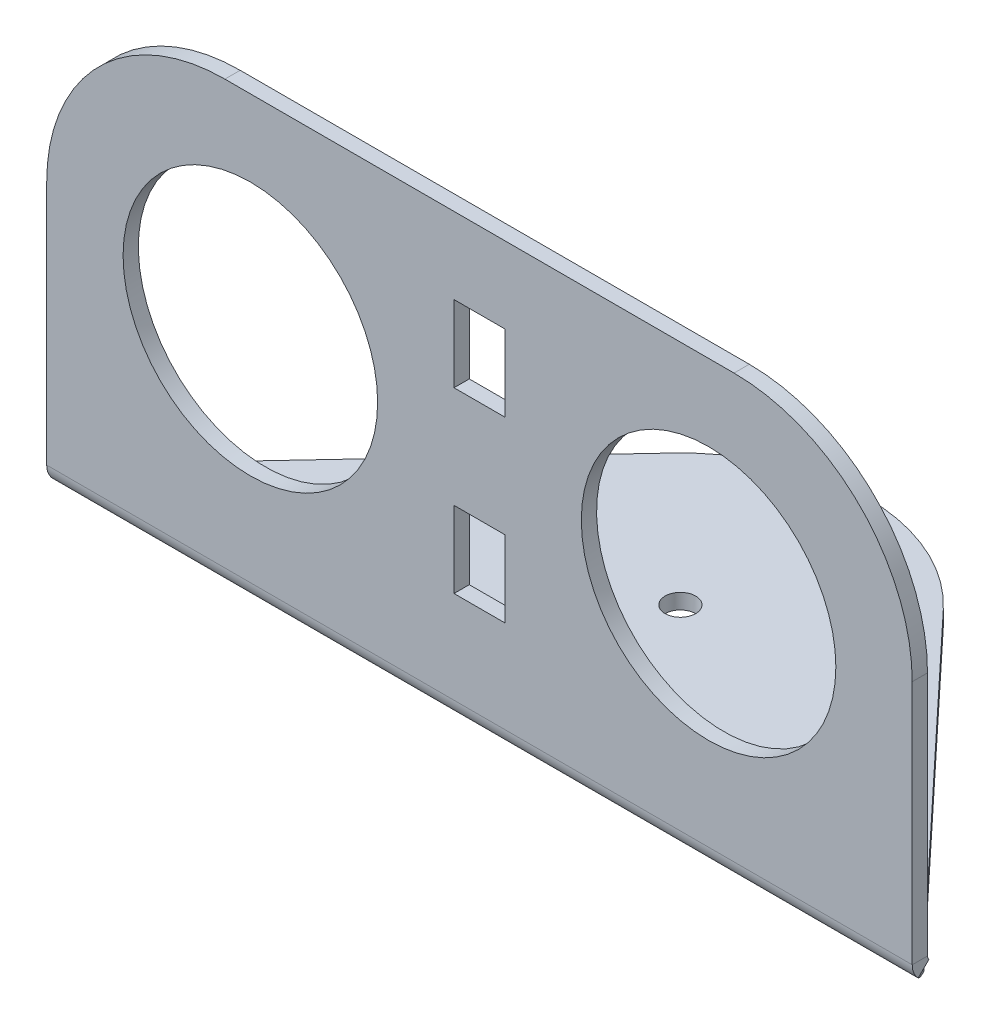
ISO-10303-21;
HEADER;
FILE_DESCRIPTION(('STEP AP214'),'2;1');
FILE_NAME('part.step','',(''),(''),'','','');
FILE_SCHEMA(('AUTOMOTIVE_DESIGN { 1 0 10303 214 1 1 1 1 }'));
ENDSEC;
DATA;
#1=APPLICATION_CONTEXT('core data for automotive mechanical design processes');
#2=APPLICATION_PROTOCOL_DEFINITION('international standard','automotive_design',2000,#1);
#3=PRODUCT_CONTEXT('',#1,'mechanical');
#4=PRODUCT('Part','Part','',(#3));
#5=PRODUCT_RELATED_PRODUCT_CATEGORY('part','',(#4));
#6=PRODUCT_DEFINITION_FORMATION('','',#4);
#7=PRODUCT_DEFINITION_CONTEXT('part definition',#1,'design');
#8=PRODUCT_DEFINITION('design','',#6,#7);
#9=PRODUCT_DEFINITION_SHAPE('','',#8);
#10=(LENGTH_UNIT() NAMED_UNIT(*) SI_UNIT(.MILLI.,.METRE.));
#11=(NAMED_UNIT(*) PLANE_ANGLE_UNIT() SI_UNIT($,.RADIAN.));
#12=(NAMED_UNIT(*) SI_UNIT($,.STERADIAN.) SOLID_ANGLE_UNIT());
#13=UNCERTAINTY_MEASURE_WITH_UNIT(LENGTH_MEASURE(1.E-05),#10,'distance_accuracy_value','');
#14=(GEOMETRIC_REPRESENTATION_CONTEXT(3) GLOBAL_UNCERTAINTY_ASSIGNED_CONTEXT((#13)) GLOBAL_UNIT_ASSIGNED_CONTEXT((#10,
#11,#12)) REPRESENTATION_CONTEXT('',''));
#15=CARTESIAN_POINT('',(0.,0.,0.));
#16=DIRECTION('',(0.,0.,1.));
#17=DIRECTION('',(1.,0.,0.));
#18=AXIS2_PLACEMENT_3D('',#15,#16,#17);
#19=CARTESIAN_POINT('',(-85.,84.154314316016,9.65431431601569));
#20=DIRECTION('',(-1.,0.,0.));
#21=DIRECTION('',(0.,1.,0.));
#22=AXIS2_PLACEMENT_3D('',#19,#20,#21);
#23=PLANE('',#22);
#24=DIRECTION('',(0.,1.,0.));
#25=VECTOR('',#24,1.);
#26=CARTESIAN_POINT('',(-85.,84.154314316016,6.65431431601569));
#27=LINE('',#26,#25);
#28=CARTESIAN_POINT('',(-84.9999999999997,1.00000000000001,6.65431431601598));
#29=VERTEX_POINT('',#28);
#30=CARTESIAN_POINT('',(-85.,49.154314316016,6.65431431601582));
#31=VERTEX_POINT('',#30);
#32=EDGE_CURVE('E232',#29,#31,#27,.T.);
#33=ORIENTED_EDGE('',*,*,#32,.F.);
#34=DIRECTION('',(0.,0.,1.));
#35=VECTOR('',#34,1.);
#36=CARTESIAN_POINT('',(-85.,1.00000000000001,9.65431431601599));
#37=LINE('',#36,#35);
#38=CARTESIAN_POINT('',(-84.9999999999999,1.00000000000004,9.65431431601598));
#39=VERTEX_POINT('',#38);
#40=EDGE_CURVE('E212',#29,#39,#37,.T.);
#41=ORIENTED_EDGE('',*,*,#40,.T.);
#42=DIRECTION('',(0.,1.,0.));
#43=VECTOR('',#42,1.);
#44=CARTESIAN_POINT('',(-85.,84.154314316016,9.65431431601569));
#45=LINE('',#44,#43);
#46=CARTESIAN_POINT('',(-85.,49.154314316016,9.65431431601582));
#47=VERTEX_POINT('',#46);
#48=EDGE_CURVE('E67',#39,#47,#45,.T.);
#49=ORIENTED_EDGE('',*,*,#48,.T.);
#50=DIRECTION('',(0.,0.,-1.));
#51=VECTOR('',#50,1.);
#52=CARTESIAN_POINT('',(-85.,49.154314316016,9.65431431601582));
#53=LINE('',#52,#51);
#54=EDGE_CURVE('E213',#47,#31,#53,.T.);
#55=ORIENTED_EDGE('',*,*,#54,.T.);
#56=EDGE_LOOP('',(#33,#41,#49,#55));
#57=FACE_BOUND('',#56,.T.);
#58=ADVANCED_FACE('F63',(#57),#23,.T.);
#59=CARTESIAN_POINT('',(85.,84.154314316016,9.65431431601569));
#60=DIRECTION('',(1.,0.,0.));
#61=DIRECTION('',(0.,-1.,0.));
#62=AXIS2_PLACEMENT_3D('',#59,#60,#61);
#63=PLANE('',#62);
#64=DIRECTION('',(0.,-1.,0.));
#65=VECTOR('',#64,1.);
#66=CARTESIAN_POINT('',(85.,84.154314316016,9.65431431601569));
#67=LINE('',#66,#65);
#68=CARTESIAN_POINT('',(85.,49.154314316016,9.65431431601582));
#69=VERTEX_POINT('',#68);
#70=CARTESIAN_POINT('',(85.,1.00000000000001,9.65431431601598));
#71=VERTEX_POINT('',#70);
#72=EDGE_CURVE('E230',#69,#71,#67,.T.);
#73=ORIENTED_EDGE('',*,*,#72,.T.);
#74=DIRECTION('',(0.,0.,-1.));
#75=VECTOR('',#74,1.);
#76=CARTESIAN_POINT('',(85.,1.00000000000001,9.65431431601599));
#77=LINE('',#76,#75);
#78=CARTESIAN_POINT('',(85.0000000000001,1.00000000000001,6.65431431601598));
#79=VERTEX_POINT('',#78);
#80=EDGE_CURVE('E12',#71,#79,#77,.T.);
#81=ORIENTED_EDGE('',*,*,#80,.T.);
#82=DIRECTION('',(0.,-1.,0.));
#83=VECTOR('',#82,1.);
#84=CARTESIAN_POINT('',(85.,84.154314316016,6.65431431601569));
#85=LINE('',#84,#83);
#86=CARTESIAN_POINT('',(85.,49.154314316016,6.65431431601582));
#87=VERTEX_POINT('',#86);
#88=EDGE_CURVE('E240',#87,#79,#85,.T.);
#89=ORIENTED_EDGE('',*,*,#88,.F.);
#90=DIRECTION('',(0.,0.,-1.));
#91=VECTOR('',#90,1.);
#92=CARTESIAN_POINT('',(85.,49.154314316016,9.65431431601582));
#93=LINE('',#92,#91);
#94=EDGE_CURVE('E260',#87,#69,#93,.F.);
#95=ORIENTED_EDGE('',*,*,#94,.T.);
#96=EDGE_LOOP('',(#73,#81,#89,#95));
#97=FACE_BOUND('',#96,.T.);
#98=ADVANCED_FACE('F65',(#97),#63,.T.);
#99=CARTESIAN_POINT('',(0.,-8.34568568398399,9.65431431601602));
#100=DIRECTION('',(0.,0.,1.));
#101=DIRECTION('',(0.,-1.,0.));
#102=AXIS2_PLACEMENT_3D('',#99,#100,#101);
#103=PLANE('',#102);
#104=DIRECTION('',(0.,1.,0.));
#105=VECTOR('',#104,1.);
#106=CARTESIAN_POINT('',(5.00000000000002,-8.34568568398399,9.65431431601602));
#107=LINE('',#106,#105);
#108=CARTESIAN_POINT('',(5.00000000000003,54.154314316016,9.6543143160158));
#109=VERTEX_POINT('',#108);
#110=CARTESIAN_POINT('',(5.00000000000003,69.154314316016,9.65431431601575));
#111=VERTEX_POINT('',#110);
#112=EDGE_CURVE('E524',#109,#111,#107,.T.);
#113=ORIENTED_EDGE('',*,*,#112,.F.);
#114=DIRECTION('',(1.,0.,0.));
#115=VECTOR('',#114,1.);
#116=CARTESIAN_POINT('',(0.,54.154314316016,9.6543143160158));
#117=LINE('',#116,#115);
#118=CARTESIAN_POINT('',(-4.99999999999997,54.154314316016,9.6543143160158));
#119=VERTEX_POINT('',#118);
#120=EDGE_CURVE('E493',#119,#109,#117,.T.);
#121=ORIENTED_EDGE('',*,*,#120,.F.);
#122=DIRECTION('',(0.,-1.,0.));
#123=VECTOR('',#122,1.);
#124=CARTESIAN_POINT('',(-4.99999999999998,-8.34568568398399,9.65431431601602));
#125=LINE('',#124,#123);
#126=CARTESIAN_POINT('',(-4.99999999999997,69.154314316016,9.65431431601575));
#127=VERTEX_POINT('',#126);
#128=EDGE_CURVE('E519',#127,#119,#125,.T.);
#129=ORIENTED_EDGE('',*,*,#128,.F.);
#130=DIRECTION('',(-1.,0.,0.));
#131=VECTOR('',#130,1.);
#132=CARTESIAN_POINT('',(0.,69.154314316016,9.65431431601575));
#133=LINE('',#132,#131);
#134=EDGE_CURVE('E522',#111,#127,#133,.T.);
#135=ORIENTED_EDGE('',*,*,#134,.F.);
#136=EDGE_LOOP('',(#113,#121,#129,#135));
#137=FACE_BOUND('',#136,.T.);
#138=DIRECTION('',(0.,1.,0.));
#139=VECTOR('',#138,1.);
#140=CARTESIAN_POINT('',(5.00000000000001,-8.34568568398399,9.65431431601602));
#141=LINE('',#140,#139);
#142=CARTESIAN_POINT('',(5.00000000000002,19.154314316016,9.65431431601592));
#143=VERTEX_POINT('',#142);
#144=CARTESIAN_POINT('',(5.00000000000002,34.154314316016,9.65431431601587));
#145=VERTEX_POINT('',#144);
#146=EDGE_CURVE('E242',#143,#145,#141,.T.);
#147=ORIENTED_EDGE('',*,*,#146,.F.);
#148=DIRECTION('',(1.,0.,0.));
#149=VECTOR('',#148,1.);
#150=CARTESIAN_POINT('',(0.,19.154314316016,9.65431431601592));
#151=LINE('',#150,#149);
#152=CARTESIAN_POINT('',(-4.99999999999999,19.154314316016,9.65431431601592));
#153=VERTEX_POINT('',#152);
#154=EDGE_CURVE('E526',#153,#143,#151,.T.);
#155=ORIENTED_EDGE('',*,*,#154,.F.);
#156=DIRECTION('',(0.,-1.,0.));
#157=VECTOR('',#156,1.);
#158=CARTESIAN_POINT('',(-4.99999999999999,-8.34568568398399,9.65431431601602));
#159=LINE('',#158,#157);
#160=CARTESIAN_POINT('',(-4.99999999999998,34.154314316016,9.65431431601587));
#161=VERTEX_POINT('',#160);
#162=EDGE_CURVE('E528',#161,#153,#159,.T.);
#163=ORIENTED_EDGE('',*,*,#162,.F.);
#164=DIRECTION('',(-1.,0.,0.));
#165=VECTOR('',#164,1.);
#166=CARTESIAN_POINT('',(0.,34.154314316016,9.65431431601587));
#167=LINE('',#166,#165);
#168=EDGE_CURVE('E531',#145,#161,#167,.T.);
#169=ORIENTED_EDGE('',*,*,#168,.F.);
#170=EDGE_LOOP('',(#147,#155,#163,#169));
#171=FACE_BOUND('',#170,.T.);
#172=CARTESIAN_POINT('',(45.,44.154314316016,9.65431431601583));
#173=DIRECTION('',(0.,0.,1.));
#174=DIRECTION('',(0.,-1.,0.));
#175=AXIS2_PLACEMENT_3D('',#172,#173,#174);
#176=CIRCLE('',#175,25.);
#177=CARTESIAN_POINT('',(45.,19.154314316016,9.65431431601592));
#178=VERTEX_POINT('',#177);
#179=EDGE_CURVE('E469',#178,#178,#176,.T.);
#180=ORIENTED_EDGE('',*,*,#179,.F.);
#181=EDGE_LOOP('',(#180));
#182=FACE_BOUND('',#181,.T.);
#183=CARTESIAN_POINT('',(-45.,44.154314316016,9.65431431601583));
#184=DIRECTION('',(0.,0.,1.));
#185=DIRECTION('',(0.,-1.,0.));
#186=AXIS2_PLACEMENT_3D('',#183,#184,#185);
#187=CIRCLE('',#186,25.);
#188=CARTESIAN_POINT('',(-45.,19.154314316016,9.65431431601592));
#189=VERTEX_POINT('',#188);
#190=EDGE_CURVE('E474',#189,#189,#187,.T.);
#191=ORIENTED_EDGE('',*,*,#190,.F.);
#192=EDGE_LOOP('',(#191));
#193=FACE_BOUND('',#192,.T.);
#194=ORIENTED_EDGE('',*,*,#48,.F.);
#195=DIRECTION('',(1.,0.,0.));
#196=VECTOR('',#195,1.);
#197=CARTESIAN_POINT('',(0.,1.00000000000001,9.65431431601598));
#198=LINE('',#197,#196);
#199=EDGE_CURVE('E203',#39,#71,#198,.T.);
#200=ORIENTED_EDGE('',*,*,#199,.T.);
#201=ORIENTED_EDGE('',*,*,#72,.F.);
#202=CARTESIAN_POINT('',(50.,49.154314316016,9.65431431601582));
#203=DIRECTION('',(0.,0.,1.));
#204=DIRECTION('',(0.,-1.,0.));
#205=AXIS2_PLACEMENT_3D('',#202,#203,#204);
#206=CIRCLE('',#205,35.);
#207=CARTESIAN_POINT('',(50.,84.154314316016,9.65431431601569));
#208=VERTEX_POINT('',#207);
#209=EDGE_CURVE('E263',#69,#208,#206,.T.);
#210=ORIENTED_EDGE('',*,*,#209,.T.);
#211=DIRECTION('',(1.,0.,0.));
#212=VECTOR('',#211,1.);
#213=CARTESIAN_POINT('',(-85.,84.154314316016,9.65431431601569));
#214=LINE('',#213,#212);
#215=CARTESIAN_POINT('',(-50.,84.154314316016,9.65431431601569));
#216=VERTEX_POINT('',#215);
#217=EDGE_CURVE('E229',#216,#208,#214,.T.);
#218=ORIENTED_EDGE('',*,*,#217,.F.);
#219=CARTESIAN_POINT('',(-50.,49.154314316016,9.65431431601582));
#220=DIRECTION('',(0.,0.,1.));
#221=DIRECTION('',(0.,-1.,0.));
#222=AXIS2_PLACEMENT_3D('',#219,#220,#221);
#223=CIRCLE('',#222,35.);
#224=EDGE_CURVE('E227',#216,#47,#223,.T.);
#225=ORIENTED_EDGE('',*,*,#224,.T.);
#226=EDGE_LOOP('',(#194,#200,#201,#210,#218,#225));
#227=FACE_BOUND('',#226,.T.);
#228=ADVANCED_FACE('F224',(#137,#171,#182,#193,#227),#103,.T.);
#229=CARTESIAN_POINT('',(-85.,84.154314316016,9.65431431601569));
#230=DIRECTION('',(0.,1.,0.));
#231=DIRECTION('',(1.,0.,0.));
#232=AXIS2_PLACEMENT_3D('',#229,#230,#231);
#233=PLANE('',#232);
#234=ORIENTED_EDGE('',*,*,#217,.T.);
#235=DIRECTION('',(0.,0.,-1.));
#236=VECTOR('',#235,1.);
#237=CARTESIAN_POINT('',(50.,84.154314316016,9.65431431601569));
#238=LINE('',#237,#236);
#239=CARTESIAN_POINT('',(50.,84.154314316016,6.65431431601569));
#240=VERTEX_POINT('',#239);
#241=EDGE_CURVE('E253',#208,#240,#238,.T.);
#242=ORIENTED_EDGE('',*,*,#241,.T.);
#243=DIRECTION('',(1.,0.,0.));
#244=VECTOR('',#243,1.);
#245=CARTESIAN_POINT('',(-85.,84.154314316016,6.65431431601569));
#246=LINE('',#245,#244);
#247=CARTESIAN_POINT('',(-50.,84.154314316016,6.65431431601569));
#248=VERTEX_POINT('',#247);
#249=EDGE_CURVE('E239',#248,#240,#246,.T.);
#250=ORIENTED_EDGE('',*,*,#249,.F.);
#251=DIRECTION('',(0.,0.,-1.));
#252=VECTOR('',#251,1.);
#253=CARTESIAN_POINT('',(-50.,84.154314316016,9.65431431601569));
#254=LINE('',#253,#252);
#255=EDGE_CURVE('E251',#248,#216,#254,.F.);
#256=ORIENTED_EDGE('',*,*,#255,.T.);
#257=EDGE_LOOP('',(#234,#242,#250,#256));
#258=FACE_BOUND('',#257,.T.);
#259=ADVANCED_FACE('F271',(#258),#233,.T.);
#260=CARTESIAN_POINT('',(0.,-8.345685683984,6.65431431601602));
#261=DIRECTION('',(0.,0.,1.));
#262=DIRECTION('',(0.,-1.,0.));
#263=AXIS2_PLACEMENT_3D('',#260,#261,#262);
#264=PLANE('',#263);
#265=DIRECTION('',(1.,0.,0.));
#266=VECTOR('',#265,1.);
#267=CARTESIAN_POINT('',(0.,1.,6.65431431601598));
#268=LINE('',#267,#266);
#269=EDGE_CURVE('E72',#29,#79,#268,.T.);
#270=ORIENTED_EDGE('',*,*,#269,.F.);
#271=ORIENTED_EDGE('',*,*,#32,.T.);
#272=CARTESIAN_POINT('',(-50.,49.154314316016,6.65431431601582));
#273=DIRECTION('',(0.,0.,1.));
#274=DIRECTION('',(0.,-1.,0.));
#275=AXIS2_PLACEMENT_3D('',#272,#273,#274);
#276=CIRCLE('',#275,35.);
#277=EDGE_CURVE('E256',#31,#248,#276,.F.);
#278=ORIENTED_EDGE('',*,*,#277,.T.);
#279=ORIENTED_EDGE('',*,*,#249,.T.);
#280=CARTESIAN_POINT('',(50.,49.154314316016,6.65431431601582));
#281=DIRECTION('',(0.,0.,1.));
#282=DIRECTION('',(0.,-1.,0.));
#283=AXIS2_PLACEMENT_3D('',#280,#281,#282);
#284=CIRCLE('',#283,35.);
#285=EDGE_CURVE('E258',#240,#87,#284,.F.);
#286=ORIENTED_EDGE('',*,*,#285,.T.);
#287=ORIENTED_EDGE('',*,*,#88,.T.);
#288=EDGE_LOOP('',(#270,#271,#278,#279,#286,#287));
#289=FACE_BOUND('',#288,.T.);
#290=CARTESIAN_POINT('',(-45.,44.154314316016,6.65431431601583));
#291=DIRECTION('',(0.,0.,-1.));
#292=DIRECTION('',(0.,1.,0.));
#293=AXIS2_PLACEMENT_3D('',#290,#291,#292);
#294=CIRCLE('',#293,25.);
#295=CARTESIAN_POINT('',(-45.,69.154314316016,6.65431431601575));
#296=VERTEX_POINT('',#295);
#297=EDGE_CURVE('E466',#296,#296,#294,.T.);
#298=ORIENTED_EDGE('',*,*,#297,.F.);
#299=EDGE_LOOP('',(#298));
#300=FACE_BOUND('',#299,.T.);
#301=CARTESIAN_POINT('',(45.,44.154314316016,6.65431431601583));
#302=DIRECTION('',(0.,0.,-1.));
#303=DIRECTION('',(0.,1.,0.));
#304=AXIS2_PLACEMENT_3D('',#301,#302,#303);
#305=CIRCLE('',#304,25.);
#306=CARTESIAN_POINT('',(45.,69.154314316016,6.65431431601575));
#307=VERTEX_POINT('',#306);
#308=EDGE_CURVE('E393',#307,#307,#305,.T.);
#309=ORIENTED_EDGE('',*,*,#308,.F.);
#310=EDGE_LOOP('',(#309));
#311=FACE_BOUND('',#310,.T.);
#312=DIRECTION('',(-1.,0.,0.));
#313=VECTOR('',#312,1.);
#314=CARTESIAN_POINT('',(-4.99999999999999,19.154314316016,6.65431431601592));
#315=LINE('',#314,#313);
#316=CARTESIAN_POINT('',(5.00000000000002,19.154314316016,6.65431431601592));
#317=VERTEX_POINT('',#316);
#318=CARTESIAN_POINT('',(-4.99999999999999,19.154314316016,6.65431431601592));
#319=VERTEX_POINT('',#318);
#320=EDGE_CURVE('E480',#317,#319,#315,.T.);
#321=ORIENTED_EDGE('',*,*,#320,.F.);
#322=DIRECTION('',(0.,-1.,0.));
#323=VECTOR('',#322,1.);
#324=CARTESIAN_POINT('',(5.00000000000002,19.154314316016,6.65431431601592));
#325=LINE('',#324,#323);
#326=CARTESIAN_POINT('',(5.00000000000002,34.154314316016,6.65431431601587));
#327=VERTEX_POINT('',#326);
#328=EDGE_CURVE('E478',#327,#317,#325,.T.);
#329=ORIENTED_EDGE('',*,*,#328,.F.);
#330=DIRECTION('',(1.,0.,0.));
#331=VECTOR('',#330,1.);
#332=CARTESIAN_POINT('',(-4.99999999999998,34.154314316016,6.65431431601587));
#333=LINE('',#332,#331);
#334=CARTESIAN_POINT('',(-4.99999999999998,34.154314316016,6.65431431601587));
#335=VERTEX_POINT('',#334);
#336=EDGE_CURVE('E487',#335,#327,#333,.T.);
#337=ORIENTED_EDGE('',*,*,#336,.F.);
#338=DIRECTION('',(0.,1.,0.));
#339=VECTOR('',#338,1.);
#340=CARTESIAN_POINT('',(-4.99999999999999,19.154314316016,6.65431431601592));
#341=LINE('',#340,#339);
#342=EDGE_CURVE('E484',#319,#335,#341,.T.);
#343=ORIENTED_EDGE('',*,*,#342,.F.);
#344=EDGE_LOOP('',(#321,#329,#337,#343));
#345=FACE_BOUND('',#344,.T.);
#346=DIRECTION('',(-1.,0.,0.));
#347=VECTOR('',#346,1.);
#348=CARTESIAN_POINT('',(-4.99999999999997,54.154314316016,6.6543143160158));
#349=LINE('',#348,#347);
#350=CARTESIAN_POINT('',(5.00000000000003,54.154314316016,6.6543143160158));
#351=VERTEX_POINT('',#350);
#352=CARTESIAN_POINT('',(-4.99999999999997,54.154314316016,6.6543143160158));
#353=VERTEX_POINT('',#352);
#354=EDGE_CURVE('E514',#351,#353,#349,.T.);
#355=ORIENTED_EDGE('',*,*,#354,.F.);
#356=DIRECTION('',(0.,-1.,0.));
#357=VECTOR('',#356,1.);
#358=CARTESIAN_POINT('',(5.00000000000003,54.154314316016,6.6543143160158));
#359=LINE('',#358,#357);
#360=CARTESIAN_POINT('',(5.00000000000003,69.154314316016,6.65431431601575));
#361=VERTEX_POINT('',#360);
#362=EDGE_CURVE('E481',#361,#351,#359,.T.);
#363=ORIENTED_EDGE('',*,*,#362,.F.);
#364=DIRECTION('',(1.,0.,0.));
#365=VECTOR('',#364,1.);
#366=CARTESIAN_POINT('',(-4.99999999999997,69.154314316016,6.65431431601575));
#367=LINE('',#366,#365);
#368=CARTESIAN_POINT('',(-4.99999999999997,69.154314316016,6.65431431601575));
#369=VERTEX_POINT('',#368);
#370=EDGE_CURVE('E503',#369,#361,#367,.T.);
#371=ORIENTED_EDGE('',*,*,#370,.F.);
#372=DIRECTION('',(0.,1.,0.));
#373=VECTOR('',#372,1.);
#374=CARTESIAN_POINT('',(-4.99999999999997,54.154314316016,6.6543143160158));
#375=LINE('',#374,#373);
#376=EDGE_CURVE('E511',#353,#369,#375,.T.);
#377=ORIENTED_EDGE('',*,*,#376,.F.);
#378=EDGE_LOOP('',(#355,#363,#371,#377));
#379=FACE_BOUND('',#378,.T.);
#380=ADVANCED_FACE('F267',(#289,#300,#311,#345,#379),#264,.F.);
#381=CARTESIAN_POINT('',(5.00000000000003,54.154314316016,16.6543143160158));
#382=DIRECTION('',(1.,0.,0.));
#383=DIRECTION('',(0.,-1.,0.));
#384=AXIS2_PLACEMENT_3D('',#381,#382,#383);
#385=PLANE('',#384);
#386=ORIENTED_EDGE('',*,*,#112,.T.);
#387=DIRECTION('',(0.,0.,-1.));
#388=VECTOR('',#387,1.);
#389=CARTESIAN_POINT('',(5.00000000000003,69.154314316016,16.6543143160157));
#390=LINE('',#389,#388);
#391=EDGE_CURVE('E477',#111,#361,#390,.T.);
#392=ORIENTED_EDGE('',*,*,#391,.T.);
#393=ORIENTED_EDGE('',*,*,#362,.T.);
#394=DIRECTION('',(0.,0.,-1.));
#395=VECTOR('',#394,1.);
#396=CARTESIAN_POINT('',(5.00000000000003,54.154314316016,16.6543143160158));
#397=LINE('',#396,#395);
#398=EDGE_CURVE('E500',#109,#351,#397,.T.);
#399=ORIENTED_EDGE('',*,*,#398,.F.);
#400=EDGE_LOOP('',(#386,#392,#393,#399));
#401=FACE_BOUND('',#400,.T.);
#402=ADVANCED_FACE('F573',(#401),#385,.F.);
#403=CARTESIAN_POINT('',(-4.99999999999997,69.154314316016,16.6543143160157));
#404=DIRECTION('',(0.,1.,0.));
#405=DIRECTION('',(1.,0.,0.));
#406=AXIS2_PLACEMENT_3D('',#403,#404,#405);
#407=PLANE('',#406);
#408=ORIENTED_EDGE('',*,*,#134,.T.);
#409=DIRECTION('',(0.,0.,-1.));
#410=VECTOR('',#409,1.);
#411=CARTESIAN_POINT('',(-4.99999999999997,69.154314316016,16.6543143160157));
#412=LINE('',#411,#410);
#413=EDGE_CURVE('E506',#127,#369,#412,.T.);
#414=ORIENTED_EDGE('',*,*,#413,.T.);
#415=ORIENTED_EDGE('',*,*,#370,.T.);
#416=ORIENTED_EDGE('',*,*,#391,.F.);
#417=EDGE_LOOP('',(#408,#414,#415,#416));
#418=FACE_BOUND('',#417,.T.);
#419=ADVANCED_FACE('F578',(#418),#407,.F.);
#420=CARTESIAN_POINT('',(-4.99999999999997,54.154314316016,16.6543143160158));
#421=DIRECTION('',(-1.,0.,0.));
#422=DIRECTION('',(0.,1.,0.));
#423=AXIS2_PLACEMENT_3D('',#420,#421,#422);
#424=PLANE('',#423);
#425=ORIENTED_EDGE('',*,*,#128,.T.);
#426=DIRECTION('',(0.,0.,-1.));
#427=VECTOR('',#426,1.);
#428=CARTESIAN_POINT('',(-4.99999999999997,54.154314316016,16.6543143160158));
#429=LINE('',#428,#427);
#430=EDGE_CURVE('E504',#119,#353,#429,.T.);
#431=ORIENTED_EDGE('',*,*,#430,.T.);
#432=ORIENTED_EDGE('',*,*,#376,.T.);
#433=ORIENTED_EDGE('',*,*,#413,.F.);
#434=EDGE_LOOP('',(#425,#431,#432,#433));
#435=FACE_BOUND('',#434,.T.);
#436=ADVANCED_FACE('F831',(#435),#424,.F.);
#437=CARTESIAN_POINT('',(-4.99999999999997,54.154314316016,16.6543143160158));
#438=DIRECTION('',(0.,-1.,0.));
#439=DIRECTION('',(-1.,0.,0.));
#440=AXIS2_PLACEMENT_3D('',#437,#438,#439);
#441=PLANE('',#440);
#442=ORIENTED_EDGE('',*,*,#120,.T.);
#443=ORIENTED_EDGE('',*,*,#398,.T.);
#444=ORIENTED_EDGE('',*,*,#354,.T.);
#445=ORIENTED_EDGE('',*,*,#430,.F.);
#446=EDGE_LOOP('',(#442,#443,#444,#445));
#447=FACE_BOUND('',#446,.T.);
#448=ADVANCED_FACE('F822',(#447),#441,.F.);
#449=CARTESIAN_POINT('',(5.00000000000002,19.1543143160161,16.6543143160159));
#450=DIRECTION('',(1.,0.,0.));
#451=DIRECTION('',(0.,-1.,0.));
#452=AXIS2_PLACEMENT_3D('',#449,#450,#451);
#453=PLANE('',#452);
#454=ORIENTED_EDGE('',*,*,#146,.T.);
#455=DIRECTION('',(0.,0.,-1.));
#456=VECTOR('',#455,1.);
#457=CARTESIAN_POINT('',(5.00000000000002,34.154314316016,16.6543143160159));
#458=LINE('',#457,#456);
#459=EDGE_CURVE('E491',#145,#327,#458,.T.);
#460=ORIENTED_EDGE('',*,*,#459,.T.);
#461=ORIENTED_EDGE('',*,*,#328,.T.);
#462=DIRECTION('',(0.,0.,-1.));
#463=VECTOR('',#462,1.);
#464=CARTESIAN_POINT('',(5.00000000000002,19.1543143160161,16.6543143160159));
#465=LINE('',#464,#463);
#466=EDGE_CURVE('E490',#143,#317,#465,.T.);
#467=ORIENTED_EDGE('',*,*,#466,.F.);
#468=EDGE_LOOP('',(#454,#460,#461,#467));
#469=FACE_BOUND('',#468,.T.);
#470=ADVANCED_FACE('F536',(#469),#453,.F.);
#471=CARTESIAN_POINT('',(-4.99999999999998,34.154314316016,16.6543143160159));
#472=DIRECTION('',(0.,1.,0.));
#473=DIRECTION('',(1.,0.,0.));
#474=AXIS2_PLACEMENT_3D('',#471,#472,#473);
#475=PLANE('',#474);
#476=ORIENTED_EDGE('',*,*,#168,.T.);
#477=DIRECTION('',(0.,0.,-1.));
#478=VECTOR('',#477,1.);
#479=CARTESIAN_POINT('',(-4.99999999999998,34.154314316016,16.6543143160159));
#480=LINE('',#479,#478);
#481=EDGE_CURVE('E494',#161,#335,#480,.T.);
#482=ORIENTED_EDGE('',*,*,#481,.T.);
#483=ORIENTED_EDGE('',*,*,#336,.T.);
#484=ORIENTED_EDGE('',*,*,#459,.F.);
#485=EDGE_LOOP('',(#476,#482,#483,#484));
#486=FACE_BOUND('',#485,.T.);
#487=ADVANCED_FACE('F541',(#486),#475,.F.);
#488=CARTESIAN_POINT('',(-4.99999999999999,19.1543143160161,16.6543143160159));
#489=DIRECTION('',(-1.,0.,0.));
#490=DIRECTION('',(0.,1.,0.));
#491=AXIS2_PLACEMENT_3D('',#488,#489,#490);
#492=PLANE('',#491);
#493=ORIENTED_EDGE('',*,*,#162,.T.);
#494=DIRECTION('',(0.,0.,-1.));
#495=VECTOR('',#494,1.);
#496=CARTESIAN_POINT('',(-4.99999999999999,19.1543143160161,16.6543143160159));
#497=LINE('',#496,#495);
#498=EDGE_CURVE('E496',#153,#319,#497,.T.);
#499=ORIENTED_EDGE('',*,*,#498,.T.);
#500=ORIENTED_EDGE('',*,*,#342,.T.);
#501=ORIENTED_EDGE('',*,*,#481,.F.);
#502=EDGE_LOOP('',(#493,#499,#500,#501));
#503=FACE_BOUND('',#502,.T.);
#504=ADVANCED_FACE('F548',(#503),#492,.F.);
#505=CARTESIAN_POINT('',(-4.99999999999999,19.1543143160161,16.6543143160159));
#506=DIRECTION('',(0.,-1.,0.));
#507=DIRECTION('',(-1.,0.,0.));
#508=AXIS2_PLACEMENT_3D('',#505,#506,#507);
#509=PLANE('',#508);
#510=ORIENTED_EDGE('',*,*,#154,.T.);
#511=ORIENTED_EDGE('',*,*,#466,.T.);
#512=ORIENTED_EDGE('',*,*,#320,.T.);
#513=ORIENTED_EDGE('',*,*,#498,.F.);
#514=EDGE_LOOP('',(#510,#511,#512,#513));
#515=FACE_BOUND('',#514,.T.);
#516=ADVANCED_FACE('F554',(#515),#509,.F.);
#517=CARTESIAN_POINT('',(45.,44.154314316016,16.6543143160158));
#518=DIRECTION('',(0.,0.,-1.));
#519=DIRECTION('',(0.,1.,0.));
#520=AXIS2_PLACEMENT_3D('',#517,#518,#519);
#521=CYLINDRICAL_SURFACE('',#520,25.);
#522=ORIENTED_EDGE('',*,*,#179,.T.);
#523=EDGE_LOOP('',(#522));
#524=FACE_BOUND('',#523,.T.);
#525=ORIENTED_EDGE('',*,*,#308,.T.);
#526=EDGE_LOOP('',(#525));
#527=FACE_BOUND('',#526,.T.);
#528=ADVANCED_FACE('F556',(#524,#527),#521,.F.);
#529=CARTESIAN_POINT('',(-45.,44.154314316016,16.6543143160158));
#530=DIRECTION('',(0.,0.,-1.));
#531=DIRECTION('',(0.,1.,0.));
#532=AXIS2_PLACEMENT_3D('',#529,#530,#531);
#533=CYLINDRICAL_SURFACE('',#532,25.);
#534=ORIENTED_EDGE('',*,*,#190,.T.);
#535=EDGE_LOOP('',(#534));
#536=FACE_BOUND('',#535,.T.);
#537=ORIENTED_EDGE('',*,*,#297,.T.);
#538=EDGE_LOOP('',(#537));
#539=FACE_BOUND('',#538,.T.);
#540=ADVANCED_FACE('F449',(#536,#539),#533,.F.);
#541=CARTESIAN_POINT('',(50.,49.154314316016,9.65431431601582));
#542=DIRECTION('',(0.,0.,-1.));
#543=DIRECTION('',(0.,1.,0.));
#544=AXIS2_PLACEMENT_3D('',#541,#542,#543);
#545=CYLINDRICAL_SURFACE('',#544,35.);
#546=ORIENTED_EDGE('',*,*,#209,.F.);
#547=ORIENTED_EDGE('',*,*,#94,.F.);
#548=ORIENTED_EDGE('',*,*,#285,.F.);
#549=ORIENTED_EDGE('',*,*,#241,.F.);
#550=EDGE_LOOP('',(#546,#547,#548,#549));
#551=FACE_BOUND('',#550,.T.);
#552=ADVANCED_FACE('F275',(#551),#545,.T.);
#553=CARTESIAN_POINT('',(-50.,49.154314316016,9.65431431601582));
#554=DIRECTION('',(0.,0.,-1.));
#555=DIRECTION('',(0.,1.,0.));
#556=AXIS2_PLACEMENT_3D('',#553,#554,#555);
#557=CYLINDRICAL_SURFACE('',#556,35.);
#558=ORIENTED_EDGE('',*,*,#224,.F.);
#559=ORIENTED_EDGE('',*,*,#255,.F.);
#560=ORIENTED_EDGE('',*,*,#277,.F.);
#561=ORIENTED_EDGE('',*,*,#54,.F.);
#562=EDGE_LOOP('',(#558,#559,#560,#561));
#563=FACE_BOUND('',#562,.T.);
#564=ADVANCED_FACE('F265',(#563),#557,.T.);
#565=CARTESIAN_POINT('',(0.,-10.,-29.8072357498176));
#566=DIRECTION('',(0.,1.,0.));
#567=DIRECTION('',(0.,0.,1.));
#568=AXIS2_PLACEMENT_3D('',#565,#566,#567);
#569=CYLINDRICAL_SURFACE('',#568,3.);
#570=CARTESIAN_POINT('',(0.,-3.,-29.8072357498176));
#571=DIRECTION('',(0.,-1.,0.));
#572=DIRECTION('',(0.,0.,-1.));
#573=AXIS2_PLACEMENT_3D('',#570,#571,#572);
#574=CIRCLE('',#573,3.);
#575=CARTESIAN_POINT('',(0.,-3.,-32.8072357498176));
#576=VERTEX_POINT('',#575);
#577=EDGE_CURVE('E408',#576,#576,#574,.T.);
#578=ORIENTED_EDGE('',*,*,#577,.T.);
#579=EDGE_LOOP('',(#578));
#580=FACE_BOUND('',#579,.T.);
#581=CARTESIAN_POINT('',(0.,0.,-29.8072357498176));
#582=DIRECTION('',(0.,1.,0.));
#583=DIRECTION('',(0.,0.,1.));
#584=AXIS2_PLACEMENT_3D('',#581,#582,#583);
#585=CIRCLE('',#584,3.);
#586=CARTESIAN_POINT('',(0.,0.,-26.8072357498176));
#587=VERTEX_POINT('',#586);
#588=EDGE_CURVE('E405',#587,#587,#585,.T.);
#589=ORIENTED_EDGE('',*,*,#588,.T.);
#590=EDGE_LOOP('',(#589));
#591=FACE_BOUND('',#590,.T.);
#592=ADVANCED_FACE('F379',(#580,#591),#569,.F.);
#593=CARTESIAN_POINT('',(0.,-10.,-29.8072357498176));
#594=DIRECTION('',(0.,1.,0.));
#595=DIRECTION('',(0.,0.,1.));
#596=AXIS2_PLACEMENT_3D('',#593,#594,#595);
#597=CYLINDRICAL_SURFACE('',#596,36.5348167139105);
#598=DIRECTION('',(0.,1.,0.));
#599=VECTOR('',#598,1.);
#600=CARTESIAN_POINT('',(-26.6652480918724,-10.,-54.7823709149759));
#601=LINE('',#600,#599);
#602=CARTESIAN_POINT('',(-26.6652480918724,-3.,-54.7823709149759));
#603=VERTEX_POINT('',#602);
#604=CARTESIAN_POINT('',(-26.6652480918724,0.,-54.7823709149759));
#605=VERTEX_POINT('',#604);
#606=EDGE_CURVE('E402',#603,#605,#601,.T.);
#607=ORIENTED_EDGE('',*,*,#606,.T.);
#608=CARTESIAN_POINT('',(0.,0.,-29.8072357498176));
#609=DIRECTION('',(0.,1.,0.));
#610=DIRECTION('',(0.,0.,1.));
#611=AXIS2_PLACEMENT_3D('',#608,#609,#610);
#612=CIRCLE('',#611,36.5348167139105);
#613=CARTESIAN_POINT('',(26.6652480918724,0.,-54.7823709149759));
#614=VERTEX_POINT('',#613);
#615=EDGE_CURVE('E394',#614,#605,#612,.T.);
#616=ORIENTED_EDGE('',*,*,#615,.F.);
#617=DIRECTION('',(0.,1.,0.));
#618=VECTOR('',#617,1.);
#619=CARTESIAN_POINT('',(26.6652480918724,-10.,-54.7823709149759));
#620=LINE('',#619,#618);
#621=CARTESIAN_POINT('',(26.6652480918724,-3.,-54.7823709149759));
#622=VERTEX_POINT('',#621);
#623=EDGE_CURVE('E385',#622,#614,#620,.T.);
#624=ORIENTED_EDGE('',*,*,#623,.F.);
#625=CARTESIAN_POINT('',(0.,-3.,-29.8072357498176));
#626=DIRECTION('',(0.,-1.,0.));
#627=DIRECTION('',(0.,0.,-1.));
#628=AXIS2_PLACEMENT_3D('',#625,#626,#627);
#629=CIRCLE('',#628,36.5348167139105);
#630=EDGE_CURVE('E398',#603,#622,#629,.T.);
#631=ORIENTED_EDGE('',*,*,#630,.F.);
#632=EDGE_LOOP('',(#607,#616,#624,#631));
#633=FACE_BOUND('',#632,.T.);
#634=ADVANCED_FACE('F594',(#633),#597,.T.);
#635=CARTESIAN_POINT('',(0.,-3.,0.));
#636=DIRECTION('',(0.,-1.,0.));
#637=DIRECTION('',(0.,0.,-1.));
#638=AXIS2_PLACEMENT_3D('',#635,#636,#637);
#639=PLANE('',#638);
#640=DIRECTION('',(1.,0.,0.));
#641=VECTOR('',#640,1.);
#642=CARTESIAN_POINT('',(0.,-3.,5.65431431601598));
#643=LINE('',#642,#641);
#644=CARTESIAN_POINT('',(-83.2712986854244,-3.,5.65431431601597));
#645=VERTEX_POINT('',#644);
#646=CARTESIAN_POINT('',(83.2712986854246,-3.,5.65431431601598));
#647=VERTEX_POINT('',#646);
#648=EDGE_CURVE('E428',#645,#647,#643,.T.);
#649=ORIENTED_EDGE('',*,*,#648,.F.);
#650=DIRECTION('',(-0.683598206081848,0.,0.729858542898334));
#651=VECTOR('',#650,1.);
#652=CARTESIAN_POINT('',(-41.5369719449016,-3.,-38.9042503974117));
#653=LINE('',#652,#651);
#654=EDGE_CURVE('E613',#603,#645,#653,.T.);
#655=ORIENTED_EDGE('',*,*,#654,.F.);
#656=ORIENTED_EDGE('',*,*,#630,.T.);
#657=DIRECTION('',(0.683598206081848,0.,0.729858542898334));
#658=VECTOR('',#657,1.);
#659=CARTESIAN_POINT('',(41.5369719449016,-3.,-38.9042503974117));
#660=LINE('',#659,#658);
#661=EDGE_CURVE('E401',#622,#647,#660,.T.);
#662=ORIENTED_EDGE('',*,*,#661,.T.);
#663=EDGE_LOOP('',(#649,#655,#656,#662));
#664=FACE_BOUND('',#663,.T.);
#665=ORIENTED_EDGE('',*,*,#577,.F.);
#666=EDGE_LOOP('',(#665));
#667=FACE_BOUND('',#666,.T.);
#668=ADVANCED_FACE('F441',(#664,#667),#639,.T.);
#669=CARTESIAN_POINT('',(-41.5369719449016,-10.,-38.9042503974117));
#670=DIRECTION('',(0.729858542898334,0.,0.683598206081848));
#671=DIRECTION('',(0.683598206081848,0.,-0.729858542898334));
#672=AXIS2_PLACEMENT_3D('',#669,#670,#671);
#673=PLANE('',#672);
#674=ORIENTED_EDGE('',*,*,#654,.T.);
#675=CARTESIAN_POINT('',(-83.2712986854244,0.,5.65431431601598));
#676=CARTESIAN_POINT('',(-83.2712986854244,-3.,5.65431431601597));
#677=B_SPLINE_CURVE_WITH_KNOTS('',1,(#675,#676),.UNSPECIFIED.,.F.,.F.,(2,2),(0.,1.),.UNSPECIFIED.);
#678=CARTESIAN_POINT('',(-83.2712986854246,0.,5.65431431601597));
#679=VERTEX_POINT('',#678);
#680=EDGE_CURVE('E354',#645,#679,#677,.F.);
#681=ORIENTED_EDGE('',*,*,#680,.T.);
#682=DIRECTION('',(0.683598206081848,0.,-0.729858542898334));
#683=VECTOR('',#682,1.);
#684=CARTESIAN_POINT('',(-41.5369719449016,0.,-38.9042503974117));
#685=LINE('',#684,#683);
#686=EDGE_CURVE('E415',#679,#605,#685,.T.);
#687=ORIENTED_EDGE('',*,*,#686,.T.);
#688=ORIENTED_EDGE('',*,*,#606,.F.);
#689=EDGE_LOOP('',(#674,#681,#687,#688));
#690=FACE_BOUND('',#689,.T.);
#691=ADVANCED_FACE('F430',(#690),#673,.F.);
#692=CARTESIAN_POINT('',(0.,0.,0.));
#693=DIRECTION('',(0.,-1.,0.));
#694=DIRECTION('',(0.,0.,-1.));
#695=AXIS2_PLACEMENT_3D('',#692,#693,#694);
#696=PLANE('',#695);
#697=ORIENTED_EDGE('',*,*,#588,.F.);
#698=EDGE_LOOP('',(#697));
#699=FACE_BOUND('',#698,.T.);
#700=ORIENTED_EDGE('',*,*,#686,.F.);
#701=DIRECTION('',(1.,0.,0.));
#702=VECTOR('',#701,1.);
#703=CARTESIAN_POINT('',(0.,0.,5.65431431601598));
#704=LINE('',#703,#702);
#705=CARTESIAN_POINT('',(83.2712986854247,0.,5.65431431601598));
#706=VERTEX_POINT('',#705);
#707=EDGE_CURVE('E412',#679,#706,#704,.T.);
#708=ORIENTED_EDGE('',*,*,#707,.T.);
#709=DIRECTION('',(-0.683598206081848,0.,-0.729858542898334));
#710=VECTOR('',#709,1.);
#711=CARTESIAN_POINT('',(41.5369719449016,0.,-38.9042503974117));
#712=LINE('',#711,#710);
#713=EDGE_CURVE('E397',#706,#614,#712,.T.);
#714=ORIENTED_EDGE('',*,*,#713,.T.);
#715=ORIENTED_EDGE('',*,*,#615,.T.);
#716=EDGE_LOOP('',(#700,#708,#714,#715));
#717=FACE_BOUND('',#716,.T.);
#718=ADVANCED_FACE('F440',(#699,#717),#696,.F.);
#719=CARTESIAN_POINT('',(41.5369719449016,-10.,-38.9042503974117));
#720=DIRECTION('',(0.729858542898334,0.,-0.683598206081848));
#721=DIRECTION('',(-0.683598206081848,0.,-0.729858542898334));
#722=AXIS2_PLACEMENT_3D('',#719,#720,#721);
#723=PLANE('',#722);
#724=CARTESIAN_POINT('',(83.2712986854247,-3.,5.65431431601598));
#725=CARTESIAN_POINT('',(83.2712986854247,0.,5.65431431601598));
#726=B_SPLINE_CURVE_WITH_KNOTS('',1,(#724,#725),.UNSPECIFIED.,.F.,.F.,(2,2),(0.,1.),.UNSPECIFIED.);
#727=EDGE_CURVE('E411',#647,#706,#726,.T.);
#728=ORIENTED_EDGE('',*,*,#727,.F.);
#729=ORIENTED_EDGE('',*,*,#661,.F.);
#730=ORIENTED_EDGE('',*,*,#623,.T.);
#731=ORIENTED_EDGE('',*,*,#713,.F.);
#732=EDGE_LOOP('',(#728,#729,#730,#731));
#733=FACE_BOUND('',#732,.T.);
#734=ADVANCED_FACE('F375',(#733),#723,.T.);
#735=CARTESIAN_POINT('',(-84.9999999999999,1.,5.65431431601598));
#736=DIRECTION('',(-1.,0.,0.));
#737=DIRECTION('',(0.,0.,1.));
#738=AXIS2_PLACEMENT_3D('',#735,#736,#737);
#739=PLANE('',#738);
#740=ORIENTED_EDGE('',*,*,#40,.F.);
#741=CARTESIAN_POINT('',(-84.9999999999998,1.,5.65431431601598));
#742=DIRECTION('',(-1.,0.,0.));
#743=DIRECTION('',(0.,0.,1.));
#744=AXIS2_PLACEMENT_3D('',#741,#742,#743);
#745=CIRCLE('',#744,1.);
#746=CARTESIAN_POINT('',(-84.9999999999998,0.292893218813456,6.36142109720253));
#747=VERTEX_POINT('',#746);
#748=EDGE_CURVE('E630',#29,#747,#745,.F.);
#749=ORIENTED_EDGE('',*,*,#748,.T.);
#750=CARTESIAN_POINT('',(-84.9999999999998,-1.82842712474617,8.48274144076219));
#751=CARTESIAN_POINT('',(-84.9999999999997,0.292893218813457,6.36142109720253));
#752=B_SPLINE_CURVE_WITH_KNOTS('',1,(#750,#751),.UNSPECIFIED.,.F.,.F.,(2,2),(0.,1.),.UNSPECIFIED.);
#753=CARTESIAN_POINT('',(-84.9999999999999,-1.82842712474618,8.48274144076218));
#754=VERTEX_POINT('',#753);
#755=EDGE_CURVE('E219',#747,#754,#752,.F.);
#756=ORIENTED_EDGE('',*,*,#755,.T.);
#757=CARTESIAN_POINT('',(-84.9999999999999,1.,5.65431431601598));
#758=DIRECTION('',(1.,0.,0.));
#759=DIRECTION('',(0.,0.,1.));
#760=AXIS2_PLACEMENT_3D('',#757,#758,#759);
#761=CIRCLE('',#760,4.);
#762=EDGE_CURVE('E207',#39,#754,#761,.T.);
#763=ORIENTED_EDGE('',*,*,#762,.F.);
#764=EDGE_LOOP('',(#740,#749,#756,#763));
#765=FACE_BOUND('',#764,.T.);
#766=ADVANCED_FACE('F216',(#765),#739,.T.);
#767=CARTESIAN_POINT('',(-84.9999999999998,-1.82842712474617,8.48274144076219));
#768=CARTESIAN_POINT('',(-84.7118432407907,-2.19871860836195,8.11244995714642));
#769=CARTESIAN_POINT('',(-84.4237662284747,-2.49514555341703,7.66879023749959));
#770=CARTESIAN_POINT('',(-83.8475324569496,-2.89589070667326,6.7013058534531));
#771=CARTESIAN_POINT('',(-83.5594554446335,-3.,6.17798555417661));
#772=CARTESIAN_POINT('',(-83.2712986854244,-3.,5.65431431601597));
#773=CARTESIAN_POINT('',(-84.9999999999997,0.292893218813457,6.36142109720253));
#774=CARTESIAN_POINT('',(-84.7118742262948,0.200330302272872,6.26885818066194));
#775=CARTESIAN_POINT('',(-84.4237662284746,0.126213611645739,6.15793329638689));
#776=CARTESIAN_POINT('',(-83.8475324569495,0.0260273233316907,5.91606220037526));
#777=CARTESIAN_POINT('',(-83.5594244591293,0.,5.78521804796051));
#778=CARTESIAN_POINT('',(-83.2712986854244,0.,5.65431431601598));
#779=B_SPLINE_SURFACE_WITH_KNOTS('',1,3,((#767,#768,#769,#770,#771,#772),(#773,#774,#775,#776,
#777,#778)),.UNSPECIFIED.,.F.,.F.,.F.,(2,2),(4,2,4),(0.,1.),(0.,0.5,1.),.UNSPECIFIED.);
#780=CARTESIAN_POINT('',(-84.9999999999997,0.292893218813457,6.36142109720253));
#781=CARTESIAN_POINT('',(-84.7118742262948,0.200330302272872,6.26885818066194));
#782=CARTESIAN_POINT('',(-84.4237662284746,0.126213611645739,6.15793329638689));
#783=CARTESIAN_POINT('',(-83.8475324569495,0.0260273233316907,5.91606220037526));
#784=CARTESIAN_POINT('',(-83.5594244591293,0.,5.78521804796051));
#785=CARTESIAN_POINT('',(-83.2712986854244,0.,5.65431431601598));
#786=B_SPLINE_CURVE_WITH_KNOTS('',3,(#780,#781,#782,#783,#784,#785),.UNSPECIFIED.,.F.,.F.,(4,2,
4),(0.,0.5,1.),.UNSPECIFIED.);
#787=EDGE_CURVE('E290',#747,#679,#786,.T.);
#788=CARTESIAN_POINT('',(-83.2712986854244,-3.,5.65431431601597));
#789=CARTESIAN_POINT('',(-83.5594554446335,-3.,6.17798555417661));
#790=CARTESIAN_POINT('',(-83.8475324569496,-2.89589070667326,6.7013058534531));
#791=CARTESIAN_POINT('',(-84.4237662284747,-2.49514555341703,7.66879023749959));
#792=CARTESIAN_POINT('',(-84.7118432407907,-2.19871860836195,8.11244995714642));
#793=CARTESIAN_POINT('',(-84.9999999999998,-1.82842712474617,8.48274144076219));
#794=B_SPLINE_CURVE_WITH_KNOTS('',3,(#788,#789,#790,#791,#792,#793),.UNSPECIFIED.,.F.,.F.,(4,2,
4),(0.,0.5,1.),.UNSPECIFIED.);
#795=EDGE_CURVE('E221',#754,#645,#794,.F.);
#796=ORIENTED_EDGE('',*,*,#755,.F.);
#797=ORIENTED_EDGE('',*,*,#787,.T.);
#798=ORIENTED_EDGE('',*,*,#680,.F.);
#799=ORIENTED_EDGE('',*,*,#795,.F.);
#800=EDGE_LOOP('',(#796,#797,#798,#799));
#801=FACE_BOUND('',#800,.T.);
#802=ADVANCED_FACE('F320',(#801),#779,.T.);
#803=CARTESIAN_POINT('',(83.2712986854247,-3.,5.65431431601598));
#804=CARTESIAN_POINT('',(83.5594554446338,-3.,6.17798555417666));
#805=CARTESIAN_POINT('',(83.8475324569498,-2.89589070667326,6.70130585345311));
#806=CARTESIAN_POINT('',(84.4237662284749,-2.49514555341702,7.66879023749959));
#807=CARTESIAN_POINT('',(84.7118432407909,-2.19871860836195,8.11244995714641));
#808=CARTESIAN_POINT('',(85.0000000000001,-1.82842712474617,8.48274144076219));
#809=CARTESIAN_POINT('',(83.2712986854247,0.,5.65431431601598));
#810=CARTESIAN_POINT('',(83.5594244591297,0.,5.78521804796054));
#811=CARTESIAN_POINT('',(83.8475324569498,0.0260273233316836,5.91606220037526));
#812=CARTESIAN_POINT('',(84.4237662284749,0.126213611645746,6.15793329638688));
#813=CARTESIAN_POINT('',(84.7118742262952,0.20033030227286,6.26885818066194));
#814=CARTESIAN_POINT('',(85.0000000000001,0.292893218813457,6.36142109720253));
#815=B_SPLINE_SURFACE_WITH_KNOTS('',1,3,((#803,#804,#805,#806,#807,#808),(#809,#810,#811,#812,
#813,#814)),.UNSPECIFIED.,.F.,.F.,.F.,(2,2),(4,2,4),(0.,1.),(0.,0.5,1.),.UNSPECIFIED.);
#816=CARTESIAN_POINT('',(83.2712986854247,0.,5.65431431601598));
#817=CARTESIAN_POINT('',(83.5594244591297,0.,5.78521804796054));
#818=CARTESIAN_POINT('',(83.8475324569498,0.0260273233316836,5.91606220037526));
#819=CARTESIAN_POINT('',(84.4237662284749,0.126213611645746,6.15793329638688));
#820=CARTESIAN_POINT('',(84.7118742262952,0.20033030227286,6.26885818066194));
#821=CARTESIAN_POINT('',(85.0000000000001,0.292893218813457,6.36142109720253));
#822=B_SPLINE_CURVE_WITH_KNOTS('',3,(#816,#817,#818,#819,#820,#821),.UNSPECIFIED.,.F.,.F.,(4,2,
4),(0.,0.5,1.),.UNSPECIFIED.);
#823=CARTESIAN_POINT('',(85.0000000000001,0.292893218813457,6.36142109720253));
#824=VERTEX_POINT('',#823);
#825=EDGE_CURVE('E288',#706,#824,#822,.T.);
#826=CARTESIAN_POINT('',(85.0000000000001,0.292893218813457,6.36142109720253));
#827=CARTESIAN_POINT('',(85.0000000000001,-1.82842712474617,8.48274144076219));
#828=B_SPLINE_CURVE_WITH_KNOTS('',1,(#826,#827),.UNSPECIFIED.,.F.,.F.,(2,2),(0.,1.),.UNSPECIFIED.);
#829=CARTESIAN_POINT('',(85.0000000000001,-1.82842712474617,8.48274144076219));
#830=VERTEX_POINT('',#829);
#831=EDGE_CURVE('E283',#824,#830,#828,.T.);
#832=CARTESIAN_POINT('',(85.0000000000001,-1.82842712474617,8.48274144076219));
#833=CARTESIAN_POINT('',(84.7118432407909,-2.19871860836195,8.11244995714641));
#834=CARTESIAN_POINT('',(84.4237662284749,-2.49514555341702,7.66879023749959));
#835=CARTESIAN_POINT('',(83.8475324569498,-2.89589070667326,6.70130585345311));
#836=CARTESIAN_POINT('',(83.5594554446338,-3.,6.17798555417666));
#837=CARTESIAN_POINT('',(83.2712986854247,-3.,5.65431431601598));
#838=B_SPLINE_CURVE_WITH_KNOTS('',3,(#832,#833,#834,#835,#836,#837),.UNSPECIFIED.,.F.,.F.,(4,2,
4),(0.,0.5,1.),.UNSPECIFIED.);
#839=EDGE_CURVE('E302',#647,#830,#838,.F.);
#840=ORIENTED_EDGE('',*,*,#727,.T.);
#841=ORIENTED_EDGE('',*,*,#825,.T.);
#842=ORIENTED_EDGE('',*,*,#831,.T.);
#843=ORIENTED_EDGE('',*,*,#839,.F.);
#844=EDGE_LOOP('',(#840,#841,#842,#843));
#845=FACE_BOUND('',#844,.T.);
#846=ADVANCED_FACE('F309',(#845),#815,.T.);
#847=CARTESIAN_POINT('',(85.,1.,5.65431431601598));
#848=DIRECTION('',(1.,0.,0.));
#849=DIRECTION('',(0.,0.,-1.));
#850=AXIS2_PLACEMENT_3D('',#847,#848,#849);
#851=PLANE('',#850);
#852=CARTESIAN_POINT('',(85.0000000000001,1.,5.65431431601598));
#853=DIRECTION('',(-1.,0.,0.));
#854=DIRECTION('',(0.,0.,1.));
#855=AXIS2_PLACEMENT_3D('',#852,#853,#854);
#856=CIRCLE('',#855,1.);
#857=EDGE_CURVE('E222',#824,#79,#856,.T.);
#858=ORIENTED_EDGE('',*,*,#857,.T.);
#859=ORIENTED_EDGE('',*,*,#80,.F.);
#860=CARTESIAN_POINT('',(85.,1.,5.65431431601598));
#861=DIRECTION('',(-1.,0.,0.));
#862=DIRECTION('',(0.,0.,-1.));
#863=AXIS2_PLACEMENT_3D('',#860,#861,#862);
#864=CIRCLE('',#863,4.);
#865=EDGE_CURVE('E80',#830,#71,#864,.T.);
#866=ORIENTED_EDGE('',*,*,#865,.F.);
#867=ORIENTED_EDGE('',*,*,#831,.F.);
#868=EDGE_LOOP('',(#858,#859,#866,#867));
#869=FACE_BOUND('',#868,.T.);
#870=ADVANCED_FACE('F281',(#869),#851,.T.);
#871=CARTESIAN_POINT('',(170.066534693267,1.,5.65431431601598));
#872=DIRECTION('',(-1.,0.,0.));
#873=DIRECTION('',(0.,0.,1.));
#874=AXIS2_PLACEMENT_3D('',#871,#872,#873);
#875=CYLINDRICAL_SURFACE('',#874,4.);
#876=ORIENTED_EDGE('',*,*,#839,.T.);
#877=ORIENTED_EDGE('',*,*,#865,.T.);
#878=ORIENTED_EDGE('',*,*,#199,.F.);
#879=ORIENTED_EDGE('',*,*,#762,.T.);
#880=ORIENTED_EDGE('',*,*,#795,.T.);
#881=ORIENTED_EDGE('',*,*,#648,.T.);
#882=EDGE_LOOP('',(#876,#877,#878,#879,#880,#881));
#883=FACE_BOUND('',#882,.T.);
#884=ADVANCED_FACE('F205',(#883),#875,.T.);
#885=CARTESIAN_POINT('',(170.066534693267,1.,5.65431431601598));
#886=DIRECTION('',(-1.,0.,0.));
#887=DIRECTION('',(0.,0.,1.));
#888=AXIS2_PLACEMENT_3D('',#885,#886,#887);
#889=CYLINDRICAL_SURFACE('',#888,1.);
#890=ORIENTED_EDGE('',*,*,#825,.F.);
#891=ORIENTED_EDGE('',*,*,#707,.F.);
#892=ORIENTED_EDGE('',*,*,#787,.F.);
#893=ORIENTED_EDGE('',*,*,#748,.F.);
#894=ORIENTED_EDGE('',*,*,#269,.T.);
#895=ORIENTED_EDGE('',*,*,#857,.F.);
#896=EDGE_LOOP('',(#890,#891,#892,#893,#894,#895));
#897=FACE_BOUND('',#896,.T.);
#898=ADVANCED_FACE('F321',(#897),#889,.F.);
#899=CLOSED_SHELL('',(#58,#98,#228,#259,#380,#402,#419,#436,#448,#470,#487,#504,#516,#528,#540,
#552,#564,#592,#634,#668,#691,#718,#734,#766,#802,#846,#870,#884,#898));
#900=MANIFOLD_SOLID_BREP('B2',#899);
#901=ADVANCED_BREP_SHAPE_REPRESENTATION('',(#18,#900),#14);
#902=SHAPE_DEFINITION_REPRESENTATION(#9,#901);
ENDSEC;
END-ISO-10303-21;
